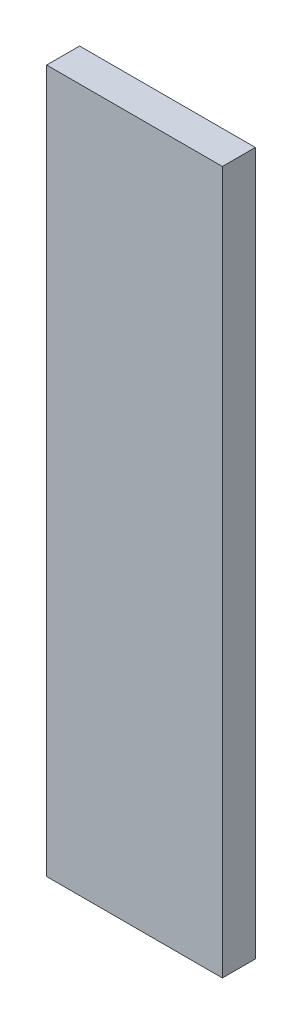
ISO-10303-21;
HEADER;
FILE_DESCRIPTION(('STEP AP214'),'2;1');
FILE_NAME('part.step','',(''),(''),'','','');
FILE_SCHEMA(('AUTOMOTIVE_DESIGN { 1 0 10303 214 1 1 1 1 }'));
ENDSEC;
DATA;
#1=APPLICATION_CONTEXT('core data for automotive mechanical design processes');
#2=APPLICATION_PROTOCOL_DEFINITION('international standard','automotive_design',2000,#1);
#3=PRODUCT_CONTEXT('',#1,'mechanical');
#4=PRODUCT('Part','Part','',(#3));
#5=PRODUCT_RELATED_PRODUCT_CATEGORY('part','',(#4));
#6=PRODUCT_DEFINITION_FORMATION('','',#4);
#7=PRODUCT_DEFINITION_CONTEXT('part definition',#1,'design');
#8=PRODUCT_DEFINITION('design','',#6,#7);
#9=PRODUCT_DEFINITION_SHAPE('','',#8);
#10=(LENGTH_UNIT() NAMED_UNIT(*) SI_UNIT(.MILLI.,.METRE.));
#11=(NAMED_UNIT(*) PLANE_ANGLE_UNIT() SI_UNIT($,.RADIAN.));
#12=(NAMED_UNIT(*) SI_UNIT($,.STERADIAN.) SOLID_ANGLE_UNIT());
#13=UNCERTAINTY_MEASURE_WITH_UNIT(LENGTH_MEASURE(1.E-05),#10,'distance_accuracy_value','');
#14=(GEOMETRIC_REPRESENTATION_CONTEXT(3) GLOBAL_UNCERTAINTY_ASSIGNED_CONTEXT((#13)) GLOBAL_UNIT_ASSIGNED_CONTEXT((#10,
#11,#12)) REPRESENTATION_CONTEXT('',''));
#15=CARTESIAN_POINT('',(0.,0.,0.));
#16=DIRECTION('',(0.,0.,1.));
#17=DIRECTION('',(1.,0.,0.));
#18=AXIS2_PLACEMENT_3D('',#15,#16,#17);
#19=CARTESIAN_POINT('',(12.7,-50.8,4.7625));
#20=DIRECTION('',(-1.,0.,0.));
#21=DIRECTION('',(0.,0.,1.));
#22=AXIS2_PLACEMENT_3D('',#19,#20,#21);
#23=PLANE('',#22);
#24=DIRECTION('',(0.,1.,0.));
#25=VECTOR('',#24,1.);
#26=CARTESIAN_POINT('',(12.7,-50.8,0.));
#27=LINE('',#26,#25);
#28=CARTESIAN_POINT('',(12.7,-50.8,0.));
#29=VERTEX_POINT('',#28);
#30=CARTESIAN_POINT('',(12.7,50.8,0.));
#31=VERTEX_POINT('',#30);
#32=EDGE_CURVE('E96',#29,#31,#27,.T.);
#33=ORIENTED_EDGE('',*,*,#32,.T.);
#34=DIRECTION('',(0.,0.,-1.));
#35=VECTOR('',#34,1.);
#36=CARTESIAN_POINT('',(12.7,50.8,4.7625));
#37=LINE('',#36,#35);
#38=CARTESIAN_POINT('',(12.7,50.8,4.7625));
#39=VERTEX_POINT('',#38);
#40=EDGE_CURVE('E11',#39,#31,#37,.T.);
#41=ORIENTED_EDGE('',*,*,#40,.F.);
#42=DIRECTION('',(0.,1.,0.));
#43=VECTOR('',#42,1.);
#44=CARTESIAN_POINT('',(12.7,-50.8,4.7625));
#45=LINE('',#44,#43);
#46=CARTESIAN_POINT('',(12.7,-50.8,4.7625));
#47=VERTEX_POINT('',#46);
#48=EDGE_CURVE('E84',#47,#39,#45,.T.);
#49=ORIENTED_EDGE('',*,*,#48,.F.);
#50=DIRECTION('',(0.,0.,-1.));
#51=VECTOR('',#50,1.);
#52=CARTESIAN_POINT('',(12.7,-50.8,4.7625));
#53=LINE('',#52,#51);
#54=EDGE_CURVE('E92',#47,#29,#53,.T.);
#55=ORIENTED_EDGE('',*,*,#54,.T.);
#56=EDGE_LOOP('',(#33,#41,#49,#55));
#57=FACE_BOUND('',#56,.T.);
#58=ADVANCED_FACE('F33',(#57),#23,.F.);
#59=CARTESIAN_POINT('',(-12.7,50.8,4.7625));
#60=DIRECTION('',(0.,-1.,0.));
#61=DIRECTION('',(0.,0.,-1.));
#62=AXIS2_PLACEMENT_3D('',#59,#60,#61);
#63=PLANE('',#62);
#64=DIRECTION('',(-1.,0.,0.));
#65=VECTOR('',#64,1.);
#66=CARTESIAN_POINT('',(-12.7,50.8,0.));
#67=LINE('',#66,#65);
#68=CARTESIAN_POINT('',(-12.7,50.8,0.));
#69=VERTEX_POINT('',#68);
#70=EDGE_CURVE('E88',#31,#69,#67,.T.);
#71=ORIENTED_EDGE('',*,*,#70,.T.);
#72=DIRECTION('',(0.,0.,-1.));
#73=VECTOR('',#72,1.);
#74=CARTESIAN_POINT('',(-12.7,50.8,4.7625));
#75=LINE('',#74,#73);
#76=CARTESIAN_POINT('',(-12.7,50.8,4.7625));
#77=VERTEX_POINT('',#76);
#78=EDGE_CURVE('E41',#77,#69,#75,.T.);
#79=ORIENTED_EDGE('',*,*,#78,.F.);
#80=DIRECTION('',(-1.,0.,0.));
#81=VECTOR('',#80,1.);
#82=CARTESIAN_POINT('',(-12.7,50.8,4.7625));
#83=LINE('',#82,#81);
#84=EDGE_CURVE('E79',#39,#77,#83,.T.);
#85=ORIENTED_EDGE('',*,*,#84,.F.);
#86=ORIENTED_EDGE('',*,*,#40,.T.);
#87=EDGE_LOOP('',(#71,#79,#85,#86));
#88=FACE_BOUND('',#87,.T.);
#89=ADVANCED_FACE('F87',(#88),#63,.F.);
#90=CARTESIAN_POINT('',(-12.7,-50.8,4.7625));
#91=DIRECTION('',(1.,0.,0.));
#92=DIRECTION('',(0.,0.,-1.));
#93=AXIS2_PLACEMENT_3D('',#90,#91,#92);
#94=PLANE('',#93);
#95=DIRECTION('',(0.,-1.,0.));
#96=VECTOR('',#95,1.);
#97=CARTESIAN_POINT('',(-12.7,-50.8,0.));
#98=LINE('',#97,#96);
#99=CARTESIAN_POINT('',(-12.7,-50.8,0.));
#100=VERTEX_POINT('',#99);
#101=EDGE_CURVE('E66',#69,#100,#98,.T.);
#102=ORIENTED_EDGE('',*,*,#101,.T.);
#103=DIRECTION('',(0.,0.,-1.));
#104=VECTOR('',#103,1.);
#105=CARTESIAN_POINT('',(-12.7,-50.8,4.7625));
#106=LINE('',#105,#104);
#107=CARTESIAN_POINT('',(-12.7,-50.8,4.7625));
#108=VERTEX_POINT('',#107);
#109=EDGE_CURVE('E89',#108,#100,#106,.T.);
#110=ORIENTED_EDGE('',*,*,#109,.F.);
#111=DIRECTION('',(0.,-1.,0.));
#112=VECTOR('',#111,1.);
#113=CARTESIAN_POINT('',(-12.7,-50.8,4.7625));
#114=LINE('',#113,#112);
#115=EDGE_CURVE('E82',#77,#108,#114,.T.);
#116=ORIENTED_EDGE('',*,*,#115,.F.);
#117=ORIENTED_EDGE('',*,*,#78,.T.);
#118=EDGE_LOOP('',(#102,#110,#116,#117));
#119=FACE_BOUND('',#118,.T.);
#120=ADVANCED_FACE('F90',(#119),#94,.F.);
#121=CARTESIAN_POINT('',(-12.7,-50.8,4.7625));
#122=DIRECTION('',(0.,1.,0.));
#123=DIRECTION('',(0.,0.,1.));
#124=AXIS2_PLACEMENT_3D('',#121,#122,#123);
#125=PLANE('',#124);
#126=DIRECTION('',(1.,0.,0.));
#127=VECTOR('',#126,1.);
#128=CARTESIAN_POINT('',(-12.7,-50.8,0.));
#129=LINE('',#128,#127);
#130=EDGE_CURVE('E72',#100,#29,#129,.T.);
#131=ORIENTED_EDGE('',*,*,#130,.T.);
#132=ORIENTED_EDGE('',*,*,#54,.F.);
#133=DIRECTION('',(1.,0.,0.));
#134=VECTOR('',#133,1.);
#135=CARTESIAN_POINT('',(-12.7,-50.8,4.7625));
#136=LINE('',#135,#134);
#137=EDGE_CURVE('E49',#108,#47,#136,.T.);
#138=ORIENTED_EDGE('',*,*,#137,.F.);
#139=ORIENTED_EDGE('',*,*,#109,.T.);
#140=EDGE_LOOP('',(#131,#132,#138,#139));
#141=FACE_BOUND('',#140,.T.);
#142=ADVANCED_FACE('F103',(#141),#125,.F.);
#143=CARTESIAN_POINT('',(0.,0.,4.7625));
#144=DIRECTION('',(0.,0.,-1.));
#145=DIRECTION('',(-1.,0.,0.));
#146=AXIS2_PLACEMENT_3D('',#143,#144,#145);
#147=PLANE('',#146);
#148=ORIENTED_EDGE('',*,*,#48,.T.);
#149=ORIENTED_EDGE('',*,*,#84,.T.);
#150=ORIENTED_EDGE('',*,*,#115,.T.);
#151=ORIENTED_EDGE('',*,*,#137,.T.);
#152=EDGE_LOOP('',(#148,#149,#150,#151));
#153=FACE_BOUND('',#152,.T.);
#154=ADVANCED_FACE('F80',(#153),#147,.F.);
#155=CARTESIAN_POINT('',(0.,0.,0.));
#156=DIRECTION('',(0.,0.,-1.));
#157=DIRECTION('',(-1.,0.,0.));
#158=AXIS2_PLACEMENT_3D('',#155,#156,#157);
#159=PLANE('',#158);
#160=ORIENTED_EDGE('',*,*,#32,.F.);
#161=ORIENTED_EDGE('',*,*,#130,.F.);
#162=ORIENTED_EDGE('',*,*,#101,.F.);
#163=ORIENTED_EDGE('',*,*,#70,.F.);
#164=EDGE_LOOP('',(#160,#161,#162,#163));
#165=FACE_BOUND('',#164,.T.);
#166=ADVANCED_FACE('F106',(#165),#159,.T.);
#167=CLOSED_SHELL('',(#58,#89,#120,#142,#154,#166));
#168=MANIFOLD_SOLID_BREP('B2',#167);
#169=ADVANCED_BREP_SHAPE_REPRESENTATION('',(#18,#168),#14);
#170=SHAPE_DEFINITION_REPRESENTATION(#9,#169);
ENDSEC;
END-ISO-10303-21;
